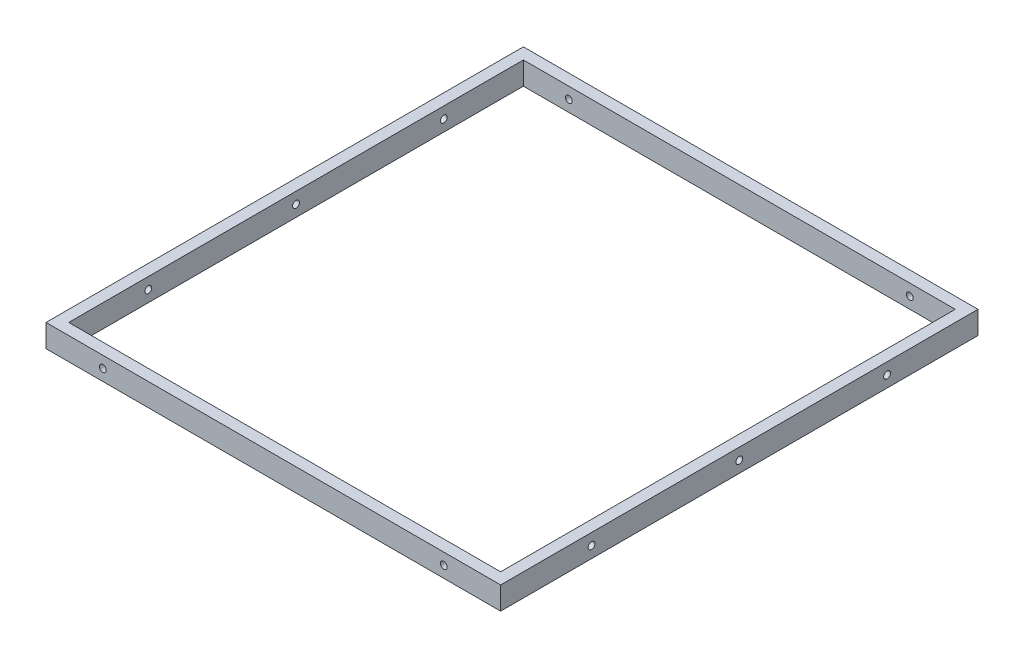
ISO-10303-21;
HEADER;
FILE_DESCRIPTION(('STEP AP214'),'2;1');
FILE_NAME('part.step','',(''),(''),'','','');
FILE_SCHEMA(('AUTOMOTIVE_DESIGN { 1 0 10303 214 1 1 1 1 }'));
ENDSEC;
DATA;
#1=APPLICATION_CONTEXT('core data for automotive mechanical design processes');
#2=APPLICATION_PROTOCOL_DEFINITION('international standard','automotive_design',2000,#1);
#3=PRODUCT_CONTEXT('',#1,'mechanical');
#4=PRODUCT('Part','Part','',(#3));
#5=PRODUCT_RELATED_PRODUCT_CATEGORY('part','',(#4));
#6=PRODUCT_DEFINITION_FORMATION('','',#4);
#7=PRODUCT_DEFINITION_CONTEXT('part definition',#1,'design');
#8=PRODUCT_DEFINITION('design','',#6,#7);
#9=PRODUCT_DEFINITION_SHAPE('','',#8);
#10=(LENGTH_UNIT() NAMED_UNIT(*) SI_UNIT(.MILLI.,.METRE.));
#11=(NAMED_UNIT(*) PLANE_ANGLE_UNIT() SI_UNIT($,.RADIAN.));
#12=(NAMED_UNIT(*) SI_UNIT($,.STERADIAN.) SOLID_ANGLE_UNIT());
#13=UNCERTAINTY_MEASURE_WITH_UNIT(LENGTH_MEASURE(1.E-05),#10,'distance_accuracy_value','');
#14=(GEOMETRIC_REPRESENTATION_CONTEXT(3) GLOBAL_UNCERTAINTY_ASSIGNED_CONTEXT((#13)) GLOBAL_UNIT_ASSIGNED_CONTEXT((#10,
#11,#12)) REPRESENTATION_CONTEXT('',''));
#15=CARTESIAN_POINT('',(0.,0.,0.));
#16=DIRECTION('',(0.,0.,1.));
#17=DIRECTION('',(1.,0.,0.));
#18=AXIS2_PLACEMENT_3D('',#15,#16,#17);
#19=CARTESIAN_POINT('',(0.,20.,0.));
#20=DIRECTION('',(0.,-1.,0.));
#21=DIRECTION('',(0.,0.,-1.));
#22=AXIS2_PLACEMENT_3D('',#19,#20,#21);
#23=PLANE('',#22);
#24=DIRECTION('',(0.,0.,1.));
#25=VECTOR('',#24,1.);
#26=CARTESIAN_POINT('',(-200.,20.,210.));
#27=LINE('',#26,#25);
#28=CARTESIAN_POINT('',(-200.,20.,-210.));
#29=VERTEX_POINT('',#28);
#30=CARTESIAN_POINT('',(-200.,20.,210.));
#31=VERTEX_POINT('',#30);
#32=EDGE_CURVE('E138',#29,#31,#27,.T.);
#33=ORIENTED_EDGE('',*,*,#32,.T.);
#34=DIRECTION('',(1.,0.,0.));
#35=VECTOR('',#34,1.);
#36=CARTESIAN_POINT('',(-200.,20.,210.));
#37=LINE('',#36,#35);
#38=CARTESIAN_POINT('',(200.,20.,210.));
#39=VERTEX_POINT('',#38);
#40=EDGE_CURVE('E141',#31,#39,#37,.T.);
#41=ORIENTED_EDGE('',*,*,#40,.T.);
#42=DIRECTION('',(0.,0.,-1.));
#43=VECTOR('',#42,1.);
#44=CARTESIAN_POINT('',(200.,20.,210.));
#45=LINE('',#44,#43);
#46=CARTESIAN_POINT('',(200.,20.,-210.));
#47=VERTEX_POINT('',#46);
#48=EDGE_CURVE('E144',#39,#47,#45,.T.);
#49=ORIENTED_EDGE('',*,*,#48,.T.);
#50=DIRECTION('',(-1.,0.,0.));
#51=VECTOR('',#50,1.);
#52=CARTESIAN_POINT('',(-200.,20.,-210.));
#53=LINE('',#52,#51);
#54=EDGE_CURVE('E146',#47,#29,#53,.T.);
#55=ORIENTED_EDGE('',*,*,#54,.T.);
#56=EDGE_LOOP('',(#33,#41,#49,#55));
#57=FACE_BOUND('',#56,.T.);
#58=DIRECTION('',(0.,0.,-1.));
#59=VECTOR('',#58,1.);
#60=CARTESIAN_POINT('',(190.,20.,200.));
#61=LINE('',#60,#59);
#62=CARTESIAN_POINT('',(190.,20.,200.));
#63=VERTEX_POINT('',#62);
#64=CARTESIAN_POINT('',(190.,20.,-200.));
#65=VERTEX_POINT('',#64);
#66=EDGE_CURVE('E100',#63,#65,#61,.T.);
#67=ORIENTED_EDGE('',*,*,#66,.F.);
#68=DIRECTION('',(1.,0.,0.));
#69=VECTOR('',#68,1.);
#70=CARTESIAN_POINT('',(-190.,20.,200.));
#71=LINE('',#70,#69);
#72=CARTESIAN_POINT('',(-190.,20.,200.));
#73=VERTEX_POINT('',#72);
#74=EDGE_CURVE('E122',#73,#63,#71,.T.);
#75=ORIENTED_EDGE('',*,*,#74,.F.);
#76=DIRECTION('',(0.,0.,1.));
#77=VECTOR('',#76,1.);
#78=CARTESIAN_POINT('',(-190.,20.,200.));
#79=LINE('',#78,#77);
#80=CARTESIAN_POINT('',(-190.,20.,-200.));
#81=VERTEX_POINT('',#80);
#82=EDGE_CURVE('E120',#81,#73,#79,.T.);
#83=ORIENTED_EDGE('',*,*,#82,.F.);
#84=DIRECTION('',(-1.,0.,0.));
#85=VECTOR('',#84,1.);
#86=CARTESIAN_POINT('',(-190.,20.,-200.));
#87=LINE('',#86,#85);
#88=EDGE_CURVE('E108',#65,#81,#87,.T.);
#89=ORIENTED_EDGE('',*,*,#88,.F.);
#90=EDGE_LOOP('',(#67,#75,#83,#89));
#91=FACE_BOUND('',#90,.T.);
#92=ADVANCED_FACE('F33',(#57,#91),#23,.F.);
#93=CARTESIAN_POINT('',(0.,0.,0.));
#94=DIRECTION('',(0.,-1.,0.));
#95=DIRECTION('',(0.,0.,-1.));
#96=AXIS2_PLACEMENT_3D('',#93,#94,#95);
#97=PLANE('',#96);
#98=DIRECTION('',(0.,0.,1.));
#99=VECTOR('',#98,1.);
#100=CARTESIAN_POINT('',(-200.,0.,210.));
#101=LINE('',#100,#99);
#102=CARTESIAN_POINT('',(-200.,0.,-210.));
#103=VERTEX_POINT('',#102);
#104=CARTESIAN_POINT('',(-200.,0.,210.));
#105=VERTEX_POINT('',#104);
#106=EDGE_CURVE('E116',#103,#105,#101,.T.);
#107=ORIENTED_EDGE('',*,*,#106,.F.);
#108=DIRECTION('',(-1.,0.,0.));
#109=VECTOR('',#108,1.);
#110=CARTESIAN_POINT('',(-200.,0.,-210.));
#111=LINE('',#110,#109);
#112=CARTESIAN_POINT('',(200.,0.,-210.));
#113=VERTEX_POINT('',#112);
#114=EDGE_CURVE('E142',#113,#103,#111,.T.);
#115=ORIENTED_EDGE('',*,*,#114,.F.);
#116=DIRECTION('',(0.,0.,-1.));
#117=VECTOR('',#116,1.);
#118=CARTESIAN_POINT('',(200.,0.,210.));
#119=LINE('',#118,#117);
#120=CARTESIAN_POINT('',(200.,0.,210.));
#121=VERTEX_POINT('',#120);
#122=EDGE_CURVE('E153',#121,#113,#119,.T.);
#123=ORIENTED_EDGE('',*,*,#122,.F.);
#124=DIRECTION('',(1.,0.,0.));
#125=VECTOR('',#124,1.);
#126=CARTESIAN_POINT('',(-200.,0.,210.));
#127=LINE('',#126,#125);
#128=EDGE_CURVE('E151',#105,#121,#127,.T.);
#129=ORIENTED_EDGE('',*,*,#128,.F.);
#130=EDGE_LOOP('',(#107,#115,#123,#129));
#131=FACE_BOUND('',#130,.T.);
#132=DIRECTION('',(1.,0.,0.));
#133=VECTOR('',#132,1.);
#134=CARTESIAN_POINT('',(-190.,0.,200.));
#135=LINE('',#134,#133);
#136=CARTESIAN_POINT('',(-190.,0.,200.));
#137=VERTEX_POINT('',#136);
#138=CARTESIAN_POINT('',(190.,0.,200.));
#139=VERTEX_POINT('',#138);
#140=EDGE_CURVE('E109',#137,#139,#135,.T.);
#141=ORIENTED_EDGE('',*,*,#140,.T.);
#142=DIRECTION('',(0.,0.,-1.));
#143=VECTOR('',#142,1.);
#144=CARTESIAN_POINT('',(190.,0.,200.));
#145=LINE('',#144,#143);
#146=CARTESIAN_POINT('',(190.,0.,-200.));
#147=VERTEX_POINT('',#146);
#148=EDGE_CURVE('E58',#139,#147,#145,.T.);
#149=ORIENTED_EDGE('',*,*,#148,.T.);
#150=DIRECTION('',(-1.,0.,0.));
#151=VECTOR('',#150,1.);
#152=CARTESIAN_POINT('',(-190.,0.,-200.));
#153=LINE('',#152,#151);
#154=CARTESIAN_POINT('',(-190.,0.,-200.));
#155=VERTEX_POINT('',#154);
#156=EDGE_CURVE('E115',#147,#155,#153,.T.);
#157=ORIENTED_EDGE('',*,*,#156,.T.);
#158=DIRECTION('',(0.,0.,1.));
#159=VECTOR('',#158,1.);
#160=CARTESIAN_POINT('',(-190.,0.,200.));
#161=LINE('',#160,#159);
#162=EDGE_CURVE('E130',#155,#137,#161,.T.);
#163=ORIENTED_EDGE('',*,*,#162,.T.);
#164=EDGE_LOOP('',(#141,#149,#157,#163));
#165=FACE_BOUND('',#164,.T.);
#166=ADVANCED_FACE('F236',(#131,#165),#97,.T.);
#167=CARTESIAN_POINT('',(-200.,20.,210.));
#168=DIRECTION('',(1.,0.,0.));
#169=DIRECTION('',(0.,0.,-1.));
#170=AXIS2_PLACEMENT_3D('',#167,#168,#169);
#171=PLANE('',#170);
#172=CARTESIAN_POINT('',(-200.,9.99999999999913,-130.));
#173=DIRECTION('',(-1.,0.,0.));
#174=DIRECTION('',(0.,0.,1.));
#175=AXIS2_PLACEMENT_3D('',#172,#173,#174);
#176=CIRCLE('',#175,2.99999999999999);
#177=CARTESIAN_POINT('',(-200.,9.99999999999913,-127.));
#178=VERTEX_POINT('',#177);
#179=EDGE_CURVE('E183',#178,#178,#176,.T.);
#180=ORIENTED_EDGE('',*,*,#179,.F.);
#181=EDGE_LOOP('',(#180));
#182=FACE_BOUND('',#181,.T.);
#183=CARTESIAN_POINT('',(-200.,10.,129.999998685776));
#184=DIRECTION('',(-1.,0.,0.));
#185=DIRECTION('',(0.,0.,1.));
#186=AXIS2_PLACEMENT_3D('',#183,#184,#185);
#187=CIRCLE('',#186,2.99999999999999);
#188=CARTESIAN_POINT('',(-200.,10.,132.999998685776));
#189=VERTEX_POINT('',#188);
#190=EDGE_CURVE('E201',#189,#189,#187,.T.);
#191=ORIENTED_EDGE('',*,*,#190,.F.);
#192=EDGE_LOOP('',(#191));
#193=FACE_BOUND('',#192,.T.);
#194=CARTESIAN_POINT('',(-200.,10.,1.02609784229137E-06));
#195=DIRECTION('',(-1.,0.,0.));
#196=DIRECTION('',(0.,0.,1.));
#197=AXIS2_PLACEMENT_3D('',#194,#195,#196);
#198=CIRCLE('',#197,3.);
#199=CARTESIAN_POINT('',(-200.,10.,3.00000102609784));
#200=VERTEX_POINT('',#199);
#201=EDGE_CURVE('E208',#200,#200,#198,.T.);
#202=ORIENTED_EDGE('',*,*,#201,.F.);
#203=EDGE_LOOP('',(#202));
#204=FACE_BOUND('',#203,.T.);
#205=ORIENTED_EDGE('',*,*,#106,.T.);
#206=DIRECTION('',(0.,-1.,0.));
#207=VECTOR('',#206,1.);
#208=CARTESIAN_POINT('',(-200.,20.,210.));
#209=LINE('',#208,#207);
#210=EDGE_CURVE('E11',#31,#105,#209,.T.);
#211=ORIENTED_EDGE('',*,*,#210,.F.);
#212=ORIENTED_EDGE('',*,*,#32,.F.);
#213=DIRECTION('',(0.,-1.,0.));
#214=VECTOR('',#213,1.);
#215=CARTESIAN_POINT('',(-200.,20.,-210.));
#216=LINE('',#215,#214);
#217=EDGE_CURVE('E148',#29,#103,#216,.T.);
#218=ORIENTED_EDGE('',*,*,#217,.T.);
#219=EDGE_LOOP('',(#205,#211,#212,#218));
#220=FACE_BOUND('',#219,.T.);
#221=ADVANCED_FACE('F35',(#182,#193,#204,#220),#171,.F.);
#222=CARTESIAN_POINT('',(-200.,20.,210.));
#223=DIRECTION('',(0.,0.,-1.));
#224=DIRECTION('',(-1.,0.,0.));
#225=AXIS2_PLACEMENT_3D('',#222,#223,#224);
#226=PLANE('',#225);
#227=CARTESIAN_POINT('',(-150.,10.,210.));
#228=DIRECTION('',(0.,0.,-1.));
#229=DIRECTION('',(-1.,0.,0.));
#230=AXIS2_PLACEMENT_3D('',#227,#228,#229);
#231=CIRCLE('',#230,2.99999999999999);
#232=CARTESIAN_POINT('',(-153.,10.,210.));
#233=VERTEX_POINT('',#232);
#234=EDGE_CURVE('E256',#233,#233,#231,.F.);
#235=ORIENTED_EDGE('',*,*,#234,.F.);
#236=EDGE_LOOP('',(#235));
#237=FACE_BOUND('',#236,.T.);
#238=CARTESIAN_POINT('',(150.,10.,210.));
#239=DIRECTION('',(0.,0.,-1.));
#240=DIRECTION('',(-1.,0.,0.));
#241=AXIS2_PLACEMENT_3D('',#238,#239,#240);
#242=CIRCLE('',#241,2.99999999999999);
#243=CARTESIAN_POINT('',(147.,10.,210.));
#244=VERTEX_POINT('',#243);
#245=EDGE_CURVE('E179',#244,#244,#242,.F.);
#246=ORIENTED_EDGE('',*,*,#245,.F.);
#247=EDGE_LOOP('',(#246));
#248=FACE_BOUND('',#247,.T.);
#249=ORIENTED_EDGE('',*,*,#128,.T.);
#250=DIRECTION('',(0.,-1.,0.));
#251=VECTOR('',#250,1.);
#252=CARTESIAN_POINT('',(200.,20.,210.));
#253=LINE('',#252,#251);
#254=EDGE_CURVE('E42',#39,#121,#253,.T.);
#255=ORIENTED_EDGE('',*,*,#254,.F.);
#256=ORIENTED_EDGE('',*,*,#40,.F.);
#257=ORIENTED_EDGE('',*,*,#210,.T.);
#258=EDGE_LOOP('',(#249,#255,#256,#257));
#259=FACE_BOUND('',#258,.T.);
#260=ADVANCED_FACE('F245',(#237,#248,#259),#226,.F.);
#261=CARTESIAN_POINT('',(200.,20.,210.));
#262=DIRECTION('',(-1.,0.,0.));
#263=DIRECTION('',(0.,0.,1.));
#264=AXIS2_PLACEMENT_3D('',#261,#262,#263);
#265=PLANE('',#264);
#266=CARTESIAN_POINT('',(200.,9.99999999999913,-130.));
#267=DIRECTION('',(-1.,0.,0.));
#268=DIRECTION('',(0.,0.,1.));
#269=AXIS2_PLACEMENT_3D('',#266,#267,#268);
#270=CIRCLE('',#269,2.99999999999999);
#271=CARTESIAN_POINT('',(200.,9.99999999999913,-127.));
#272=VERTEX_POINT('',#271);
#273=EDGE_CURVE('E175',#272,#272,#270,.F.);
#274=ORIENTED_EDGE('',*,*,#273,.F.);
#275=EDGE_LOOP('',(#274));
#276=FACE_BOUND('',#275,.T.);
#277=CARTESIAN_POINT('',(200.,10.,129.999998685776));
#278=DIRECTION('',(-1.,0.,0.));
#279=DIRECTION('',(0.,0.,1.));
#280=AXIS2_PLACEMENT_3D('',#277,#278,#279);
#281=CIRCLE('',#280,2.99999999999999);
#282=CARTESIAN_POINT('',(200.,10.,132.999998685776));
#283=VERTEX_POINT('',#282);
#284=EDGE_CURVE('E171',#283,#283,#281,.F.);
#285=ORIENTED_EDGE('',*,*,#284,.F.);
#286=EDGE_LOOP('',(#285));
#287=FACE_BOUND('',#286,.T.);
#288=CARTESIAN_POINT('',(200.,10.,1.02609784229137E-06));
#289=DIRECTION('',(-1.,0.,0.));
#290=DIRECTION('',(0.,0.,1.));
#291=AXIS2_PLACEMENT_3D('',#288,#289,#290);
#292=CIRCLE('',#291,3.);
#293=CARTESIAN_POINT('',(200.,10.,3.00000102609784));
#294=VERTEX_POINT('',#293);
#295=EDGE_CURVE('E166',#294,#294,#292,.F.);
#296=ORIENTED_EDGE('',*,*,#295,.F.);
#297=EDGE_LOOP('',(#296));
#298=FACE_BOUND('',#297,.T.);
#299=ORIENTED_EDGE('',*,*,#122,.T.);
#300=DIRECTION('',(0.,-1.,0.));
#301=VECTOR('',#300,1.);
#302=CARTESIAN_POINT('',(200.,20.,-210.));
#303=LINE('',#302,#301);
#304=EDGE_CURVE('E158',#47,#113,#303,.T.);
#305=ORIENTED_EDGE('',*,*,#304,.F.);
#306=ORIENTED_EDGE('',*,*,#48,.F.);
#307=ORIENTED_EDGE('',*,*,#254,.T.);
#308=EDGE_LOOP('',(#299,#305,#306,#307));
#309=FACE_BOUND('',#308,.T.);
#310=ADVANCED_FACE('F229',(#276,#287,#298,#309),#265,.F.);
#311=CARTESIAN_POINT('',(-200.,20.,-210.));
#312=DIRECTION('',(0.,0.,1.));
#313=DIRECTION('',(1.,0.,0.));
#314=AXIS2_PLACEMENT_3D('',#311,#312,#313);
#315=PLANE('',#314);
#316=CARTESIAN_POINT('',(-150.,10.,-210.));
#317=DIRECTION('',(0.,0.,-1.));
#318=DIRECTION('',(-1.,0.,0.));
#319=AXIS2_PLACEMENT_3D('',#316,#317,#318);
#320=CIRCLE('',#319,2.99999999999999);
#321=CARTESIAN_POINT('',(-153.,10.,-210.));
#322=VERTEX_POINT('',#321);
#323=EDGE_CURVE('E315',#322,#322,#320,.T.);
#324=ORIENTED_EDGE('',*,*,#323,.F.);
#325=EDGE_LOOP('',(#324));
#326=FACE_BOUND('',#325,.T.);
#327=CARTESIAN_POINT('',(150.,10.,-210.));
#328=DIRECTION('',(0.,0.,-1.));
#329=DIRECTION('',(-1.,0.,0.));
#330=AXIS2_PLACEMENT_3D('',#327,#328,#329);
#331=CIRCLE('',#330,2.99999999999999);
#332=CARTESIAN_POINT('',(147.,10.,-210.));
#333=VERTEX_POINT('',#332);
#334=EDGE_CURVE('E186',#333,#333,#331,.T.);
#335=ORIENTED_EDGE('',*,*,#334,.F.);
#336=EDGE_LOOP('',(#335));
#337=FACE_BOUND('',#336,.T.);
#338=ORIENTED_EDGE('',*,*,#114,.T.);
#339=ORIENTED_EDGE('',*,*,#217,.F.);
#340=ORIENTED_EDGE('',*,*,#54,.F.);
#341=ORIENTED_EDGE('',*,*,#304,.T.);
#342=EDGE_LOOP('',(#338,#339,#340,#341));
#343=FACE_BOUND('',#342,.T.);
#344=ADVANCED_FACE('F219',(#326,#337,#343),#315,.F.);
#345=CARTESIAN_POINT('',(190.,20.,200.));
#346=DIRECTION('',(-1.,0.,0.));
#347=DIRECTION('',(0.,0.,1.));
#348=AXIS2_PLACEMENT_3D('',#345,#346,#347);
#349=PLANE('',#348);
#350=CARTESIAN_POINT('',(190.,9.99999999999913,-130.));
#351=DIRECTION('',(-1.,0.,0.));
#352=DIRECTION('',(0.,0.,1.));
#353=AXIS2_PLACEMENT_3D('',#350,#351,#352);
#354=CIRCLE('',#353,2.99999999999999);
#355=CARTESIAN_POINT('',(190.,9.99999999999913,-127.));
#356=VERTEX_POINT('',#355);
#357=EDGE_CURVE('E174',#356,#356,#354,.T.);
#358=ORIENTED_EDGE('',*,*,#357,.F.);
#359=EDGE_LOOP('',(#358));
#360=FACE_BOUND('',#359,.T.);
#361=CARTESIAN_POINT('',(190.,10.,129.999998685776));
#362=DIRECTION('',(-1.,0.,0.));
#363=DIRECTION('',(0.,0.,1.));
#364=AXIS2_PLACEMENT_3D('',#361,#362,#363);
#365=CIRCLE('',#364,2.99999999999999);
#366=CARTESIAN_POINT('',(190.,10.,132.999998685776));
#367=VERTEX_POINT('',#366);
#368=EDGE_CURVE('E170',#367,#367,#365,.T.);
#369=ORIENTED_EDGE('',*,*,#368,.F.);
#370=EDGE_LOOP('',(#369));
#371=FACE_BOUND('',#370,.T.);
#372=CARTESIAN_POINT('',(190.,10.,1.02609784229137E-06));
#373=DIRECTION('',(-1.,0.,0.));
#374=DIRECTION('',(0.,0.,1.));
#375=AXIS2_PLACEMENT_3D('',#372,#373,#374);
#376=CIRCLE('',#375,3.);
#377=CARTESIAN_POINT('',(190.,10.,3.00000102609784));
#378=VERTEX_POINT('',#377);
#379=EDGE_CURVE('E128',#378,#378,#376,.T.);
#380=ORIENTED_EDGE('',*,*,#379,.F.);
#381=EDGE_LOOP('',(#380));
#382=FACE_BOUND('',#381,.T.);
#383=ORIENTED_EDGE('',*,*,#148,.F.);
#384=DIRECTION('',(0.,-1.,0.));
#385=VECTOR('',#384,1.);
#386=CARTESIAN_POINT('',(190.,20.,200.));
#387=LINE('',#386,#385);
#388=EDGE_CURVE('E104',#63,#139,#387,.T.);
#389=ORIENTED_EDGE('',*,*,#388,.F.);
#390=ORIENTED_EDGE('',*,*,#66,.T.);
#391=DIRECTION('',(0.,-1.,0.));
#392=VECTOR('',#391,1.);
#393=CARTESIAN_POINT('',(190.,20.,-200.));
#394=LINE('',#393,#392);
#395=EDGE_CURVE('E103',#65,#147,#394,.T.);
#396=ORIENTED_EDGE('',*,*,#395,.T.);
#397=EDGE_LOOP('',(#383,#389,#390,#396));
#398=FACE_BOUND('',#397,.T.);
#399=ADVANCED_FACE('F102',(#360,#371,#382,#398),#349,.T.);
#400=CARTESIAN_POINT('',(-190.,20.,-200.));
#401=DIRECTION('',(0.,0.,1.));
#402=DIRECTION('',(1.,0.,0.));
#403=AXIS2_PLACEMENT_3D('',#400,#401,#402);
#404=PLANE('',#403);
#405=CARTESIAN_POINT('',(-150.,10.,-200.));
#406=DIRECTION('',(0.,0.,1.));
#407=DIRECTION('',(1.,0.,0.));
#408=AXIS2_PLACEMENT_3D('',#405,#406,#407);
#409=CIRCLE('',#408,2.99999999999999);
#410=CARTESIAN_POINT('',(-147.,10.,-200.));
#411=VERTEX_POINT('',#410);
#412=EDGE_CURVE('E191',#411,#411,#409,.T.);
#413=ORIENTED_EDGE('',*,*,#412,.F.);
#414=EDGE_LOOP('',(#413));
#415=FACE_BOUND('',#414,.T.);
#416=CARTESIAN_POINT('',(150.,10.,-200.));
#417=DIRECTION('',(0.,0.,1.));
#418=DIRECTION('',(1.,0.,0.));
#419=AXIS2_PLACEMENT_3D('',#416,#417,#418);
#420=CIRCLE('',#419,2.99999999999999);
#421=CARTESIAN_POINT('',(153.,10.,-200.));
#422=VERTEX_POINT('',#421);
#423=EDGE_CURVE('E178',#422,#422,#420,.T.);
#424=ORIENTED_EDGE('',*,*,#423,.F.);
#425=EDGE_LOOP('',(#424));
#426=FACE_BOUND('',#425,.T.);
#427=ORIENTED_EDGE('',*,*,#156,.F.);
#428=ORIENTED_EDGE('',*,*,#395,.F.);
#429=ORIENTED_EDGE('',*,*,#88,.T.);
#430=DIRECTION('',(0.,-1.,0.));
#431=VECTOR('',#430,1.);
#432=CARTESIAN_POINT('',(-190.,20.,-200.));
#433=LINE('',#432,#431);
#434=EDGE_CURVE('E117',#81,#155,#433,.T.);
#435=ORIENTED_EDGE('',*,*,#434,.T.);
#436=EDGE_LOOP('',(#427,#428,#429,#435));
#437=FACE_BOUND('',#436,.T.);
#438=ADVANCED_FACE('F112',(#415,#426,#437),#404,.T.);
#439=CARTESIAN_POINT('',(-190.,20.,200.));
#440=DIRECTION('',(1.,0.,0.));
#441=DIRECTION('',(0.,0.,-1.));
#442=AXIS2_PLACEMENT_3D('',#439,#440,#441);
#443=PLANE('',#442);
#444=CARTESIAN_POINT('',(-190.,9.99999999999913,-130.));
#445=DIRECTION('',(1.,0.,0.));
#446=DIRECTION('',(0.,0.,-1.));
#447=AXIS2_PLACEMENT_3D('',#444,#445,#446);
#448=CIRCLE('',#447,2.99999999999999);
#449=CARTESIAN_POINT('',(-190.,9.99999999999913,-133.));
#450=VERTEX_POINT('',#449);
#451=EDGE_CURVE('E172',#450,#450,#448,.T.);
#452=ORIENTED_EDGE('',*,*,#451,.F.);
#453=EDGE_LOOP('',(#452));
#454=FACE_BOUND('',#453,.T.);
#455=CARTESIAN_POINT('',(-190.,10.,129.999998685776));
#456=DIRECTION('',(1.,0.,0.));
#457=DIRECTION('',(0.,0.,-1.));
#458=AXIS2_PLACEMENT_3D('',#455,#456,#457);
#459=CIRCLE('',#458,2.99999999999999);
#460=CARTESIAN_POINT('',(-190.,10.,126.999998685776));
#461=VERTEX_POINT('',#460);
#462=EDGE_CURVE('E167',#461,#461,#459,.T.);
#463=ORIENTED_EDGE('',*,*,#462,.F.);
#464=EDGE_LOOP('',(#463));
#465=FACE_BOUND('',#464,.T.);
#466=CARTESIAN_POINT('',(-190.,10.,1.02609784229137E-06));
#467=DIRECTION('',(1.,0.,0.));
#468=DIRECTION('',(0.,0.,-1.));
#469=AXIS2_PLACEMENT_3D('',#466,#467,#468);
#470=CIRCLE('',#469,3.);
#471=CARTESIAN_POINT('',(-190.,10.,-2.99999897390216));
#472=VERTEX_POINT('',#471);
#473=EDGE_CURVE('E163',#472,#472,#470,.T.);
#474=ORIENTED_EDGE('',*,*,#473,.F.);
#475=EDGE_LOOP('',(#474));
#476=FACE_BOUND('',#475,.T.);
#477=ORIENTED_EDGE('',*,*,#162,.F.);
#478=ORIENTED_EDGE('',*,*,#434,.F.);
#479=ORIENTED_EDGE('',*,*,#82,.T.);
#480=DIRECTION('',(0.,-1.,0.));
#481=VECTOR('',#480,1.);
#482=CARTESIAN_POINT('',(-190.,20.,200.));
#483=LINE('',#482,#481);
#484=EDGE_CURVE('E50',#73,#137,#483,.T.);
#485=ORIENTED_EDGE('',*,*,#484,.T.);
#486=EDGE_LOOP('',(#477,#478,#479,#485));
#487=FACE_BOUND('',#486,.T.);
#488=ADVANCED_FACE('F226',(#454,#465,#476,#487),#443,.T.);
#489=CARTESIAN_POINT('',(-190.,20.,200.));
#490=DIRECTION('',(0.,0.,-1.));
#491=DIRECTION('',(-1.,0.,0.));
#492=AXIS2_PLACEMENT_3D('',#489,#490,#491);
#493=PLANE('',#492);
#494=CARTESIAN_POINT('',(-150.,10.,200.));
#495=DIRECTION('',(0.,0.,-1.));
#496=DIRECTION('',(-1.,0.,0.));
#497=AXIS2_PLACEMENT_3D('',#494,#495,#496);
#498=CIRCLE('',#497,2.99999999999999);
#499=CARTESIAN_POINT('',(-153.,10.,200.));
#500=VERTEX_POINT('',#499);
#501=EDGE_CURVE('E37',#500,#500,#498,.T.);
#502=ORIENTED_EDGE('',*,*,#501,.F.);
#503=EDGE_LOOP('',(#502));
#504=FACE_BOUND('',#503,.T.);
#505=CARTESIAN_POINT('',(150.,10.,200.));
#506=DIRECTION('',(0.,0.,-1.));
#507=DIRECTION('',(-1.,0.,0.));
#508=AXIS2_PLACEMENT_3D('',#505,#506,#507);
#509=CIRCLE('',#508,2.99999999999999);
#510=CARTESIAN_POINT('',(147.,10.,200.));
#511=VERTEX_POINT('',#510);
#512=EDGE_CURVE('E176',#511,#511,#509,.T.);
#513=ORIENTED_EDGE('',*,*,#512,.F.);
#514=EDGE_LOOP('',(#513));
#515=FACE_BOUND('',#514,.T.);
#516=ORIENTED_EDGE('',*,*,#140,.F.);
#517=ORIENTED_EDGE('',*,*,#484,.F.);
#518=ORIENTED_EDGE('',*,*,#74,.T.);
#519=ORIENTED_EDGE('',*,*,#388,.T.);
#520=EDGE_LOOP('',(#516,#517,#518,#519));
#521=FACE_BOUND('',#520,.T.);
#522=ADVANCED_FACE('F273',(#504,#515,#521),#493,.T.);
#523=CARTESIAN_POINT('',(208.485281374239,10.,1.02609784229137E-06));
#524=DIRECTION('',(-1.,0.,0.));
#525=DIRECTION('',(0.,0.,1.));
#526=AXIS2_PLACEMENT_3D('',#523,#524,#525);
#527=CYLINDRICAL_SURFACE('',#526,3.);
#528=ORIENTED_EDGE('',*,*,#473,.T.);
#529=EDGE_LOOP('',(#528));
#530=FACE_BOUND('',#529,.T.);
#531=ORIENTED_EDGE('',*,*,#201,.T.);
#532=EDGE_LOOP('',(#531));
#533=FACE_BOUND('',#532,.T.);
#534=ADVANCED_FACE('F275',(#530,#533),#527,.F.);
#535=ORIENTED_EDGE('',*,*,#379,.T.);
#536=EDGE_LOOP('',(#535));
#537=FACE_BOUND('',#536,.T.);
#538=ORIENTED_EDGE('',*,*,#295,.T.);
#539=EDGE_LOOP('',(#538));
#540=FACE_BOUND('',#539,.T.);
#541=ADVANCED_FACE('F215',(#537,#540),#527,.F.);
#542=CARTESIAN_POINT('',(208.485281374239,10.,129.999998685776));
#543=DIRECTION('',(-1.,0.,0.));
#544=DIRECTION('',(0.,0.,1.));
#545=AXIS2_PLACEMENT_3D('',#542,#543,#544);
#546=CYLINDRICAL_SURFACE('',#545,2.99999999999999);
#547=ORIENTED_EDGE('',*,*,#462,.T.);
#548=EDGE_LOOP('',(#547));
#549=FACE_BOUND('',#548,.T.);
#550=ORIENTED_EDGE('',*,*,#190,.T.);
#551=EDGE_LOOP('',(#550));
#552=FACE_BOUND('',#551,.T.);
#553=ADVANCED_FACE('F289',(#549,#552),#546,.F.);
#554=ORIENTED_EDGE('',*,*,#368,.T.);
#555=EDGE_LOOP('',(#554));
#556=FACE_BOUND('',#555,.T.);
#557=ORIENTED_EDGE('',*,*,#284,.T.);
#558=EDGE_LOOP('',(#557));
#559=FACE_BOUND('',#558,.T.);
#560=ADVANCED_FACE('F292',(#556,#559),#546,.F.);
#561=CARTESIAN_POINT('',(208.485281374239,9.99999999999913,-130.));
#562=DIRECTION('',(-1.,0.,0.));
#563=DIRECTION('',(0.,0.,1.));
#564=AXIS2_PLACEMENT_3D('',#561,#562,#563);
#565=CYLINDRICAL_SURFACE('',#564,2.99999999999999);
#566=ORIENTED_EDGE('',*,*,#451,.T.);
#567=EDGE_LOOP('',(#566));
#568=FACE_BOUND('',#567,.T.);
#569=ORIENTED_EDGE('',*,*,#179,.T.);
#570=EDGE_LOOP('',(#569));
#571=FACE_BOUND('',#570,.T.);
#572=ADVANCED_FACE('F294',(#568,#571),#565,.F.);
#573=ORIENTED_EDGE('',*,*,#357,.T.);
#574=EDGE_LOOP('',(#573));
#575=FACE_BOUND('',#574,.T.);
#576=ORIENTED_EDGE('',*,*,#273,.T.);
#577=EDGE_LOOP('',(#576));
#578=FACE_BOUND('',#577,.T.);
#579=ADVANCED_FACE('F297',(#575,#578),#565,.F.);
#580=CARTESIAN_POINT('',(150.,10.,218.485281374239));
#581=DIRECTION('',(0.,0.,-1.));
#582=DIRECTION('',(-1.,0.,0.));
#583=AXIS2_PLACEMENT_3D('',#580,#581,#582);
#584=CYLINDRICAL_SURFACE('',#583,2.99999999999999);
#585=ORIENTED_EDGE('',*,*,#512,.T.);
#586=EDGE_LOOP('',(#585));
#587=FACE_BOUND('',#586,.T.);
#588=ORIENTED_EDGE('',*,*,#245,.T.);
#589=EDGE_LOOP('',(#588));
#590=FACE_BOUND('',#589,.T.);
#591=ADVANCED_FACE('F299',(#587,#590),#584,.F.);
#592=ORIENTED_EDGE('',*,*,#423,.T.);
#593=EDGE_LOOP('',(#592));
#594=FACE_BOUND('',#593,.T.);
#595=ORIENTED_EDGE('',*,*,#334,.T.);
#596=EDGE_LOOP('',(#595));
#597=FACE_BOUND('',#596,.T.);
#598=ADVANCED_FACE('F302',(#594,#597),#584,.F.);
#599=CARTESIAN_POINT('',(-150.,10.,218.485281374239));
#600=DIRECTION('',(0.,0.,-1.));
#601=DIRECTION('',(-1.,0.,0.));
#602=AXIS2_PLACEMENT_3D('',#599,#600,#601);
#603=CYLINDRICAL_SURFACE('',#602,2.99999999999999);
#604=ORIENTED_EDGE('',*,*,#501,.T.);
#605=EDGE_LOOP('',(#604));
#606=FACE_BOUND('',#605,.T.);
#607=ORIENTED_EDGE('',*,*,#234,.T.);
#608=EDGE_LOOP('',(#607));
#609=FACE_BOUND('',#608,.T.);
#610=ADVANCED_FACE('F303',(#606,#609),#603,.F.);
#611=ORIENTED_EDGE('',*,*,#412,.T.);
#612=EDGE_LOOP('',(#611));
#613=FACE_BOUND('',#612,.T.);
#614=ORIENTED_EDGE('',*,*,#323,.T.);
#615=EDGE_LOOP('',(#614));
#616=FACE_BOUND('',#615,.T.);
#617=ADVANCED_FACE('F305',(#613,#616),#603,.F.);
#618=CLOSED_SHELL('',(#92,#166,#221,#260,#310,#344,#399,#438,#488,#522,#534,#541,#553,#560,#572,
#579,#591,#598,#610,#617));
#619=MANIFOLD_SOLID_BREP('B2',#618);
#620=ADVANCED_BREP_SHAPE_REPRESENTATION('',(#18,#619),#14);
#621=SHAPE_DEFINITION_REPRESENTATION(#9,#620);
ENDSEC;
END-ISO-10303-21;
